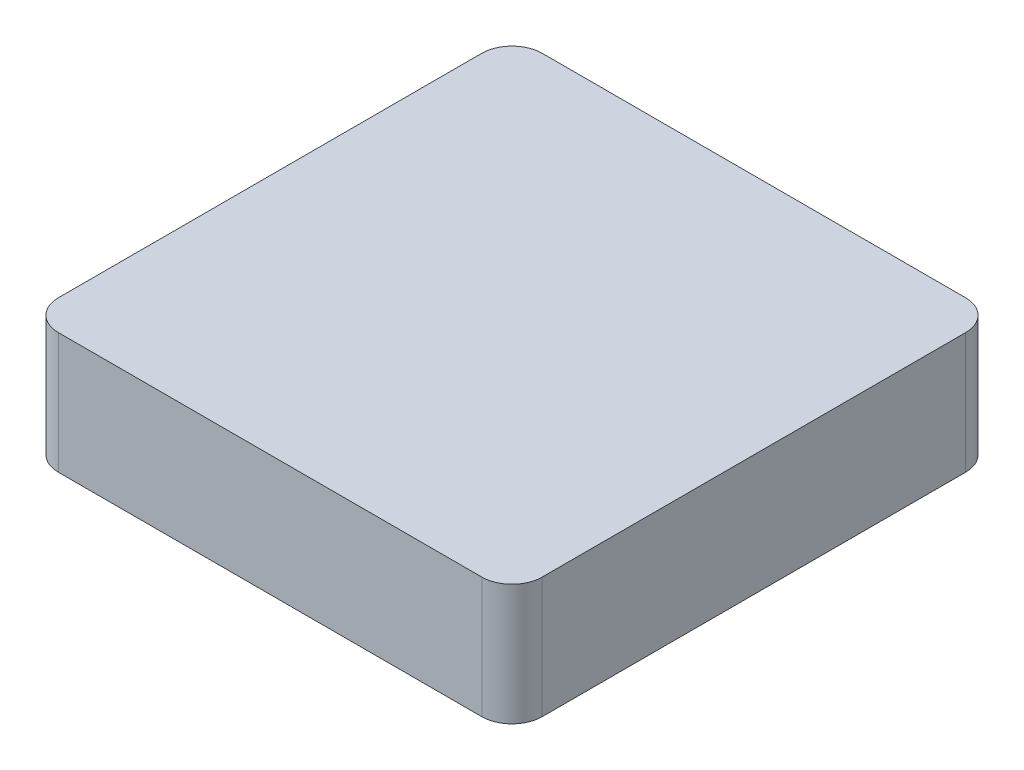
ISO-10303-21;
HEADER;
FILE_DESCRIPTION(('STEP AP214'),'2;1');
FILE_NAME('part.step','',(''),(''),'','','');
FILE_SCHEMA(('AUTOMOTIVE_DESIGN { 1 0 10303 214 1 1 1 1 }'));
ENDSEC;
DATA;
#1=APPLICATION_CONTEXT('core data for automotive mechanical design processes');
#2=APPLICATION_PROTOCOL_DEFINITION('international standard','automotive_design',2000,#1);
#3=PRODUCT_CONTEXT('',#1,'mechanical');
#4=PRODUCT('Part','Part','',(#3));
#5=PRODUCT_RELATED_PRODUCT_CATEGORY('part','',(#4));
#6=PRODUCT_DEFINITION_FORMATION('','',#4);
#7=PRODUCT_DEFINITION_CONTEXT('part definition',#1,'design');
#8=PRODUCT_DEFINITION('design','',#6,#7);
#9=PRODUCT_DEFINITION_SHAPE('','',#8);
#10=(LENGTH_UNIT() NAMED_UNIT(*) SI_UNIT(.MILLI.,.METRE.));
#11=(NAMED_UNIT(*) PLANE_ANGLE_UNIT() SI_UNIT($,.RADIAN.));
#12=(NAMED_UNIT(*) SI_UNIT($,.STERADIAN.) SOLID_ANGLE_UNIT());
#13=UNCERTAINTY_MEASURE_WITH_UNIT(LENGTH_MEASURE(1.E-05),#10,'distance_accuracy_value','');
#14=(GEOMETRIC_REPRESENTATION_CONTEXT(3) GLOBAL_UNCERTAINTY_ASSIGNED_CONTEXT((#13)) GLOBAL_UNIT_ASSIGNED_CONTEXT((#10,
#11,#12)) REPRESENTATION_CONTEXT('',''));
#15=CARTESIAN_POINT('',(0.,0.,0.));
#16=DIRECTION('',(0.,0.,1.));
#17=DIRECTION('',(1.,0.,0.));
#18=AXIS2_PLACEMENT_3D('',#15,#16,#17);
#19=CARTESIAN_POINT('',(0.,0.,-80.));
#20=DIRECTION('',(0.,-1.,0.));
#21=DIRECTION('',(0.,0.,-1.));
#22=AXIS2_PLACEMENT_3D('',#19,#20,#21);
#23=PLANE('',#22);
#24=DIRECTION('',(-1.,0.,0.));
#25=VECTOR('',#24,1.);
#26=CARTESIAN_POINT('',(0.,0.,-80.));
#27=LINE('',#26,#25);
#28=CARTESIAN_POINT('',(75.,0.,-80.));
#29=VERTEX_POINT('',#28);
#30=CARTESIAN_POINT('',(4.99999999999997,0.,-80.));
#31=VERTEX_POINT('',#30);
#32=EDGE_CURVE('E212',#29,#31,#27,.T.);
#33=ORIENTED_EDGE('',*,*,#32,.F.);
#34=CARTESIAN_POINT('',(75.,0.,-75.));
#35=DIRECTION('',(0.,-1.,0.));
#36=DIRECTION('',(0.,0.,-1.));
#37=AXIS2_PLACEMENT_3D('',#34,#35,#36);
#38=CIRCLE('',#37,5.);
#39=CARTESIAN_POINT('',(80.,0.,-75.));
#40=VERTEX_POINT('',#39);
#41=EDGE_CURVE('E240',#29,#40,#38,.T.);
#42=ORIENTED_EDGE('',*,*,#41,.T.);
#43=DIRECTION('',(0.,0.,-1.));
#44=VECTOR('',#43,1.);
#45=CARTESIAN_POINT('',(80.,0.,0.));
#46=LINE('',#45,#44);
#47=CARTESIAN_POINT('',(80.,0.,-5.));
#48=VERTEX_POINT('',#47);
#49=EDGE_CURVE('E225',#48,#40,#46,.T.);
#50=ORIENTED_EDGE('',*,*,#49,.F.);
#51=CARTESIAN_POINT('',(75.,0.,-5.));
#52=DIRECTION('',(0.,-1.,0.));
#53=DIRECTION('',(0.,0.,-1.));
#54=AXIS2_PLACEMENT_3D('',#51,#52,#53);
#55=CIRCLE('',#54,5.);
#56=CARTESIAN_POINT('',(75.,0.,0.));
#57=VERTEX_POINT('',#56);
#58=EDGE_CURVE('E238',#48,#57,#55,.T.);
#59=ORIENTED_EDGE('',*,*,#58,.T.);
#60=DIRECTION('',(1.,0.,0.));
#61=VECTOR('',#60,1.);
#62=CARTESIAN_POINT('',(0.,0.,0.));
#63=LINE('',#62,#61);
#64=CARTESIAN_POINT('',(5.,0.,0.));
#65=VERTEX_POINT('',#64);
#66=EDGE_CURVE('E223',#65,#57,#63,.T.);
#67=ORIENTED_EDGE('',*,*,#66,.F.);
#68=CARTESIAN_POINT('',(5.,0.,-5.));
#69=DIRECTION('',(0.,-1.,0.));
#70=DIRECTION('',(0.,0.,-1.));
#71=AXIS2_PLACEMENT_3D('',#68,#69,#70);
#72=CIRCLE('',#71,5.);
#73=CARTESIAN_POINT('',(0.,0.,-5.));
#74=VERTEX_POINT('',#73);
#75=EDGE_CURVE('E236',#65,#74,#72,.T.);
#76=ORIENTED_EDGE('',*,*,#75,.T.);
#77=DIRECTION('',(0.,0.,1.));
#78=VECTOR('',#77,1.);
#79=CARTESIAN_POINT('',(0.,0.,0.));
#80=LINE('',#79,#78);
#81=CARTESIAN_POINT('',(0.,0.,-75.));
#82=VERTEX_POINT('',#81);
#83=EDGE_CURVE('E153',#82,#74,#80,.T.);
#84=ORIENTED_EDGE('',*,*,#83,.F.);
#85=CARTESIAN_POINT('',(4.99999999999997,0.,-75.));
#86=DIRECTION('',(0.,-1.,0.));
#87=DIRECTION('',(0.,0.,-1.));
#88=AXIS2_PLACEMENT_3D('',#85,#86,#87);
#89=CIRCLE('',#88,5.);
#90=EDGE_CURVE('E234',#82,#31,#89,.T.);
#91=ORIENTED_EDGE('',*,*,#90,.T.);
#92=EDGE_LOOP('',(#33,#42,#50,#59,#67,#76,#84,#91));
#93=FACE_BOUND('',#92,.T.);
#94=CARTESIAN_POINT('',(75.,0.,-75.));
#95=DIRECTION('',(0.,-1.,0.));
#96=DIRECTION('',(0.,0.,-1.));
#97=AXIS2_PLACEMENT_3D('',#94,#95,#96);
#98=CIRCLE('',#97,3.);
#99=CARTESIAN_POINT('',(75.,0.,-78.));
#100=VERTEX_POINT('',#99);
#101=CARTESIAN_POINT('',(78.,0.,-75.));
#102=VERTEX_POINT('',#101);
#103=EDGE_CURVE('E186',#100,#102,#98,.T.);
#104=ORIENTED_EDGE('',*,*,#103,.F.);
#105=DIRECTION('',(-1.,0.,0.));
#106=VECTOR('',#105,1.);
#107=CARTESIAN_POINT('',(0.,0.,-78.));
#108=LINE('',#107,#106);
#109=CARTESIAN_POINT('',(4.99999999999997,0.,-78.));
#110=VERTEX_POINT('',#109);
#111=EDGE_CURVE('E162',#100,#110,#108,.T.);
#112=ORIENTED_EDGE('',*,*,#111,.T.);
#113=CARTESIAN_POINT('',(4.99999999999997,0.,-75.));
#114=DIRECTION('',(0.,-1.,0.));
#115=DIRECTION('',(0.,0.,-1.));
#116=AXIS2_PLACEMENT_3D('',#113,#114,#115);
#117=CIRCLE('',#116,3.);
#118=CARTESIAN_POINT('',(1.99999999999997,0.,-75.));
#119=VERTEX_POINT('',#118);
#120=EDGE_CURVE('E190',#119,#110,#117,.T.);
#121=ORIENTED_EDGE('',*,*,#120,.F.);
#122=DIRECTION('',(0.,0.,1.));
#123=VECTOR('',#122,1.);
#124=CARTESIAN_POINT('',(1.99999999999997,0.,-80.));
#125=LINE('',#124,#123);
#126=CARTESIAN_POINT('',(2.,0.,-5.));
#127=VERTEX_POINT('',#126);
#128=EDGE_CURVE('E46',#119,#127,#125,.T.);
#129=ORIENTED_EDGE('',*,*,#128,.T.);
#130=CARTESIAN_POINT('',(5.,0.,-5.));
#131=DIRECTION('',(0.,-1.,0.));
#132=DIRECTION('',(0.,0.,-1.));
#133=AXIS2_PLACEMENT_3D('',#130,#131,#132);
#134=CIRCLE('',#133,3.);
#135=CARTESIAN_POINT('',(5.,0.,-2.));
#136=VERTEX_POINT('',#135);
#137=EDGE_CURVE('E152',#136,#127,#134,.T.);
#138=ORIENTED_EDGE('',*,*,#137,.F.);
#139=DIRECTION('',(1.,0.,0.));
#140=VECTOR('',#139,1.);
#141=CARTESIAN_POINT('',(0.,0.,-2.));
#142=LINE('',#141,#140);
#143=CARTESIAN_POINT('',(75.,0.,-2.));
#144=VERTEX_POINT('',#143);
#145=EDGE_CURVE('E195',#136,#144,#142,.T.);
#146=ORIENTED_EDGE('',*,*,#145,.T.);
#147=CARTESIAN_POINT('',(75.,0.,-5.));
#148=DIRECTION('',(0.,-1.,0.));
#149=DIRECTION('',(0.,0.,-1.));
#150=AXIS2_PLACEMENT_3D('',#147,#148,#149);
#151=CIRCLE('',#150,3.);
#152=CARTESIAN_POINT('',(78.,0.,-5.));
#153=VERTEX_POINT('',#152);
#154=EDGE_CURVE('E201',#153,#144,#151,.T.);
#155=ORIENTED_EDGE('',*,*,#154,.F.);
#156=DIRECTION('',(0.,0.,-1.));
#157=VECTOR('',#156,1.);
#158=CARTESIAN_POINT('',(78.,0.,-80.));
#159=LINE('',#158,#157);
#160=EDGE_CURVE('E199',#153,#102,#159,.T.);
#161=ORIENTED_EDGE('',*,*,#160,.T.);
#162=EDGE_LOOP('',(#104,#112,#121,#129,#138,#146,#155,#161));
#163=FACE_BOUND('',#162,.T.);
#164=ADVANCED_FACE('F31',(#93,#163),#23,.T.);
#165=CARTESIAN_POINT('',(0.,20.,0.));
#166=DIRECTION('',(1.,0.,0.));
#167=DIRECTION('',(0.,0.,-1.));
#168=AXIS2_PLACEMENT_3D('',#165,#166,#167);
#169=PLANE('',#168);
#170=ORIENTED_EDGE('',*,*,#83,.T.);
#171=DIRECTION('',(0.,-1.,0.));
#172=VECTOR('',#171,1.);
#173=CARTESIAN_POINT('',(0.,20.,-5.));
#174=LINE('',#173,#172);
#175=CARTESIAN_POINT('',(0.,20.,-5.));
#176=VERTEX_POINT('',#175);
#177=EDGE_CURVE('E11',#74,#176,#174,.F.);
#178=ORIENTED_EDGE('',*,*,#177,.T.);
#179=DIRECTION('',(0.,0.,1.));
#180=VECTOR('',#179,1.);
#181=CARTESIAN_POINT('',(0.,20.,0.));
#182=LINE('',#181,#180);
#183=CARTESIAN_POINT('',(0.,20.,-75.));
#184=VERTEX_POINT('',#183);
#185=EDGE_CURVE('E208',#184,#176,#182,.T.);
#186=ORIENTED_EDGE('',*,*,#185,.F.);
#187=DIRECTION('',(0.,-1.,0.));
#188=VECTOR('',#187,1.);
#189=CARTESIAN_POINT('',(0.,20.,-75.));
#190=LINE('',#189,#188);
#191=EDGE_CURVE('E39',#184,#82,#190,.T.);
#192=ORIENTED_EDGE('',*,*,#191,.T.);
#193=EDGE_LOOP('',(#170,#178,#186,#192));
#194=FACE_BOUND('',#193,.T.);
#195=ADVANCED_FACE('F263',(#194),#169,.F.);
#196=CARTESIAN_POINT('',(0.,20.,0.));
#197=DIRECTION('',(0.,0.,-1.));
#198=DIRECTION('',(-1.,0.,0.));
#199=AXIS2_PLACEMENT_3D('',#196,#197,#198);
#200=PLANE('',#199);
#201=ORIENTED_EDGE('',*,*,#66,.T.);
#202=DIRECTION('',(0.,-1.,0.));
#203=VECTOR('',#202,1.);
#204=CARTESIAN_POINT('',(75.,20.,0.));
#205=LINE('',#204,#203);
#206=CARTESIAN_POINT('',(75.,20.,0.));
#207=VERTEX_POINT('',#206);
#208=EDGE_CURVE('E54',#57,#207,#205,.F.);
#209=ORIENTED_EDGE('',*,*,#208,.T.);
#210=DIRECTION('',(1.,0.,0.));
#211=VECTOR('',#210,1.);
#212=CARTESIAN_POINT('',(0.,20.,0.));
#213=LINE('',#212,#211);
#214=CARTESIAN_POINT('',(5.,20.,0.));
#215=VERTEX_POINT('',#214);
#216=EDGE_CURVE('E211',#215,#207,#213,.T.);
#217=ORIENTED_EDGE('',*,*,#216,.F.);
#218=DIRECTION('',(0.,-1.,0.));
#219=VECTOR('',#218,1.);
#220=CARTESIAN_POINT('',(5.,20.,0.));
#221=LINE('',#220,#219);
#222=EDGE_CURVE('E255',#215,#65,#221,.T.);
#223=ORIENTED_EDGE('',*,*,#222,.T.);
#224=EDGE_LOOP('',(#201,#209,#217,#223));
#225=FACE_BOUND('',#224,.T.);
#226=ADVANCED_FACE('F275',(#225),#200,.F.);
#227=CARTESIAN_POINT('',(80.,20.,0.));
#228=DIRECTION('',(-1.,0.,0.));
#229=DIRECTION('',(0.,0.,1.));
#230=AXIS2_PLACEMENT_3D('',#227,#228,#229);
#231=PLANE('',#230);
#232=ORIENTED_EDGE('',*,*,#49,.T.);
#233=DIRECTION('',(0.,-1.,0.));
#234=VECTOR('',#233,1.);
#235=CARTESIAN_POINT('',(80.,20.,-75.));
#236=LINE('',#235,#234);
#237=CARTESIAN_POINT('',(80.,20.,-75.));
#238=VERTEX_POINT('',#237);
#239=EDGE_CURVE('E245',#40,#238,#236,.F.);
#240=ORIENTED_EDGE('',*,*,#239,.T.);
#241=DIRECTION('',(0.,0.,-1.));
#242=VECTOR('',#241,1.);
#243=CARTESIAN_POINT('',(80.,20.,0.));
#244=LINE('',#243,#242);
#245=CARTESIAN_POINT('',(80.,20.,-5.));
#246=VERTEX_POINT('',#245);
#247=EDGE_CURVE('E214',#246,#238,#244,.T.);
#248=ORIENTED_EDGE('',*,*,#247,.F.);
#249=DIRECTION('',(0.,-1.,0.));
#250=VECTOR('',#249,1.);
#251=CARTESIAN_POINT('',(80.,20.,-5.));
#252=LINE('',#251,#250);
#253=EDGE_CURVE('E242',#246,#48,#252,.T.);
#254=ORIENTED_EDGE('',*,*,#253,.T.);
#255=EDGE_LOOP('',(#232,#240,#248,#254));
#256=FACE_BOUND('',#255,.T.);
#257=ADVANCED_FACE('F285',(#256),#231,.F.);
#258=CARTESIAN_POINT('',(0.,20.,-80.));
#259=DIRECTION('',(0.,0.,1.));
#260=DIRECTION('',(1.,0.,0.));
#261=AXIS2_PLACEMENT_3D('',#258,#259,#260);
#262=PLANE('',#261);
#263=DIRECTION('',(-1.,0.,0.));
#264=VECTOR('',#263,1.);
#265=CARTESIAN_POINT('',(0.,20.,-80.));
#266=LINE('',#265,#264);
#267=CARTESIAN_POINT('',(75.,20.,-80.));
#268=VERTEX_POINT('',#267);
#269=CARTESIAN_POINT('',(4.99999999999997,20.,-80.));
#270=VERTEX_POINT('',#269);
#271=EDGE_CURVE('E217',#268,#270,#266,.T.);
#272=ORIENTED_EDGE('',*,*,#271,.F.);
#273=DIRECTION('',(0.,-1.,0.));
#274=VECTOR('',#273,1.);
#275=CARTESIAN_POINT('',(75.,20.,-80.));
#276=LINE('',#275,#274);
#277=EDGE_CURVE('E231',#268,#29,#276,.T.);
#278=ORIENTED_EDGE('',*,*,#277,.T.);
#279=ORIENTED_EDGE('',*,*,#32,.T.);
#280=DIRECTION('',(0.,-1.,0.));
#281=VECTOR('',#280,1.);
#282=CARTESIAN_POINT('',(4.99999999999997,20.,-80.));
#283=LINE('',#282,#281);
#284=EDGE_CURVE('E220',#31,#270,#283,.F.);
#285=ORIENTED_EDGE('',*,*,#284,.T.);
#286=EDGE_LOOP('',(#272,#278,#279,#285));
#287=FACE_BOUND('',#286,.T.);
#288=ADVANCED_FACE('F293',(#287),#262,.F.);
#289=CARTESIAN_POINT('',(0.,20.,-80.));
#290=DIRECTION('',(0.,-1.,0.));
#291=DIRECTION('',(0.,0.,-1.));
#292=AXIS2_PLACEMENT_3D('',#289,#290,#291);
#293=PLANE('',#292);
#294=ORIENTED_EDGE('',*,*,#247,.T.);
#295=CARTESIAN_POINT('',(75.,20.,-75.));
#296=DIRECTION('',(0.,-1.,0.));
#297=DIRECTION('',(0.,0.,-1.));
#298=AXIS2_PLACEMENT_3D('',#295,#296,#297);
#299=CIRCLE('',#298,5.);
#300=EDGE_CURVE('E253',#238,#268,#299,.F.);
#301=ORIENTED_EDGE('',*,*,#300,.T.);
#302=ORIENTED_EDGE('',*,*,#271,.T.);
#303=CARTESIAN_POINT('',(4.99999999999997,20.,-75.));
#304=DIRECTION('',(0.,-1.,0.));
#305=DIRECTION('',(0.,0.,-1.));
#306=AXIS2_PLACEMENT_3D('',#303,#304,#305);
#307=CIRCLE('',#306,5.);
#308=EDGE_CURVE('E247',#270,#184,#307,.F.);
#309=ORIENTED_EDGE('',*,*,#308,.T.);
#310=ORIENTED_EDGE('',*,*,#185,.T.);
#311=CARTESIAN_POINT('',(5.,20.,-5.));
#312=DIRECTION('',(0.,-1.,0.));
#313=DIRECTION('',(0.,0.,-1.));
#314=AXIS2_PLACEMENT_3D('',#311,#312,#313);
#315=CIRCLE('',#314,5.);
#316=EDGE_CURVE('E249',#176,#215,#315,.F.);
#317=ORIENTED_EDGE('',*,*,#316,.T.);
#318=ORIENTED_EDGE('',*,*,#216,.T.);
#319=CARTESIAN_POINT('',(75.,20.,-5.));
#320=DIRECTION('',(0.,-1.,0.));
#321=DIRECTION('',(0.,0.,-1.));
#322=AXIS2_PLACEMENT_3D('',#319,#320,#321);
#323=CIRCLE('',#322,5.);
#324=EDGE_CURVE('E251',#207,#246,#323,.F.);
#325=ORIENTED_EDGE('',*,*,#324,.T.);
#326=EDGE_LOOP('',(#294,#301,#302,#309,#310,#317,#318,#325));
#327=FACE_BOUND('',#326,.T.);
#328=ADVANCED_FACE('F278',(#327),#293,.F.);
#329=CARTESIAN_POINT('',(75.,20.,-75.));
#330=DIRECTION('',(0.,-1.,0.));
#331=DIRECTION('',(0.,0.,-1.));
#332=AXIS2_PLACEMENT_3D('',#329,#330,#331);
#333=CYLINDRICAL_SURFACE('',#332,5.);
#334=ORIENTED_EDGE('',*,*,#300,.F.);
#335=ORIENTED_EDGE('',*,*,#239,.F.);
#336=ORIENTED_EDGE('',*,*,#41,.F.);
#337=ORIENTED_EDGE('',*,*,#277,.F.);
#338=EDGE_LOOP('',(#334,#335,#336,#337));
#339=FACE_BOUND('',#338,.T.);
#340=ADVANCED_FACE('F290',(#339),#333,.T.);
#341=CARTESIAN_POINT('',(75.,20.,-5.));
#342=DIRECTION('',(0.,-1.,0.));
#343=DIRECTION('',(0.,0.,-1.));
#344=AXIS2_PLACEMENT_3D('',#341,#342,#343);
#345=CYLINDRICAL_SURFACE('',#344,5.);
#346=ORIENTED_EDGE('',*,*,#324,.F.);
#347=ORIENTED_EDGE('',*,*,#208,.F.);
#348=ORIENTED_EDGE('',*,*,#58,.F.);
#349=ORIENTED_EDGE('',*,*,#253,.F.);
#350=EDGE_LOOP('',(#346,#347,#348,#349));
#351=FACE_BOUND('',#350,.T.);
#352=ADVANCED_FACE('F282',(#351),#345,.T.);
#353=CARTESIAN_POINT('',(5.,20.,-5.));
#354=DIRECTION('',(0.,-1.,0.));
#355=DIRECTION('',(0.,0.,-1.));
#356=AXIS2_PLACEMENT_3D('',#353,#354,#355);
#357=CYLINDRICAL_SURFACE('',#356,5.);
#358=ORIENTED_EDGE('',*,*,#316,.F.);
#359=ORIENTED_EDGE('',*,*,#177,.F.);
#360=ORIENTED_EDGE('',*,*,#75,.F.);
#361=ORIENTED_EDGE('',*,*,#222,.F.);
#362=EDGE_LOOP('',(#358,#359,#360,#361));
#363=FACE_BOUND('',#362,.T.);
#364=ADVANCED_FACE('F274',(#363),#357,.T.);
#365=CARTESIAN_POINT('',(4.99999999999997,20.,-75.));
#366=DIRECTION('',(0.,-1.,0.));
#367=DIRECTION('',(0.,0.,-1.));
#368=AXIS2_PLACEMENT_3D('',#365,#366,#367);
#369=CYLINDRICAL_SURFACE('',#368,5.);
#370=ORIENTED_EDGE('',*,*,#308,.F.);
#371=ORIENTED_EDGE('',*,*,#284,.F.);
#372=ORIENTED_EDGE('',*,*,#90,.F.);
#373=ORIENTED_EDGE('',*,*,#191,.F.);
#374=EDGE_LOOP('',(#370,#371,#372,#373));
#375=FACE_BOUND('',#374,.T.);
#376=ADVANCED_FACE('F33',(#375),#369,.T.);
#377=CARTESIAN_POINT('',(2.,20.,0.));
#378=DIRECTION('',(1.,0.,0.));
#379=DIRECTION('',(0.,0.,-1.));
#380=AXIS2_PLACEMENT_3D('',#377,#378,#379);
#381=PLANE('',#380);
#382=ORIENTED_EDGE('',*,*,#128,.F.);
#383=DIRECTION('',(0.,1.,0.));
#384=VECTOR('',#383,1.);
#385=CARTESIAN_POINT('',(1.99999999999997,20.,-75.));
#386=LINE('',#385,#384);
#387=CARTESIAN_POINT('',(1.99999999999997,18.,-75.));
#388=VERTEX_POINT('',#387);
#389=EDGE_CURVE('E154',#388,#119,#386,.F.);
#390=ORIENTED_EDGE('',*,*,#389,.F.);
#391=DIRECTION('',(0.,0.,1.));
#392=VECTOR('',#391,1.);
#393=CARTESIAN_POINT('',(1.99999999999997,18.,-80.));
#394=LINE('',#393,#392);
#395=CARTESIAN_POINT('',(2.,18.,-5.));
#396=VERTEX_POINT('',#395);
#397=EDGE_CURVE('E157',#388,#396,#394,.T.);
#398=ORIENTED_EDGE('',*,*,#397,.T.);
#399=DIRECTION('',(0.,1.,0.));
#400=VECTOR('',#399,1.);
#401=CARTESIAN_POINT('',(2.,20.,-5.));
#402=LINE('',#401,#400);
#403=EDGE_CURVE('E145',#127,#396,#402,.T.);
#404=ORIENTED_EDGE('',*,*,#403,.F.);
#405=EDGE_LOOP('',(#382,#390,#398,#404));
#406=FACE_BOUND('',#405,.T.);
#407=ADVANCED_FACE('F158',(#406),#381,.T.);
#408=CARTESIAN_POINT('',(0.,20.,-2.));
#409=DIRECTION('',(0.,0.,-1.));
#410=DIRECTION('',(-1.,0.,0.));
#411=AXIS2_PLACEMENT_3D('',#408,#409,#410);
#412=PLANE('',#411);
#413=ORIENTED_EDGE('',*,*,#145,.F.);
#414=DIRECTION('',(0.,1.,0.));
#415=VECTOR('',#414,1.);
#416=CARTESIAN_POINT('',(5.,20.,-2.));
#417=LINE('',#416,#415);
#418=CARTESIAN_POINT('',(5.,18.,-2.));
#419=VERTEX_POINT('',#418);
#420=EDGE_CURVE('E182',#419,#136,#417,.F.);
#421=ORIENTED_EDGE('',*,*,#420,.F.);
#422=DIRECTION('',(1.,0.,0.));
#423=VECTOR('',#422,1.);
#424=CARTESIAN_POINT('',(0.,18.,-2.));
#425=LINE('',#424,#423);
#426=CARTESIAN_POINT('',(75.,18.,-2.));
#427=VERTEX_POINT('',#426);
#428=EDGE_CURVE('E161',#419,#427,#425,.T.);
#429=ORIENTED_EDGE('',*,*,#428,.T.);
#430=DIRECTION('',(0.,1.,0.));
#431=VECTOR('',#430,1.);
#432=CARTESIAN_POINT('',(75.,20.,-2.));
#433=LINE('',#432,#431);
#434=EDGE_CURVE('E180',#144,#427,#433,.T.);
#435=ORIENTED_EDGE('',*,*,#434,.F.);
#436=EDGE_LOOP('',(#413,#421,#429,#435));
#437=FACE_BOUND('',#436,.T.);
#438=ADVANCED_FACE('F300',(#437),#412,.T.);
#439=CARTESIAN_POINT('',(78.,20.,0.));
#440=DIRECTION('',(-1.,0.,0.));
#441=DIRECTION('',(0.,0.,1.));
#442=AXIS2_PLACEMENT_3D('',#439,#440,#441);
#443=PLANE('',#442);
#444=ORIENTED_EDGE('',*,*,#160,.F.);
#445=DIRECTION('',(0.,1.,0.));
#446=VECTOR('',#445,1.);
#447=CARTESIAN_POINT('',(78.,20.,-5.));
#448=LINE('',#447,#446);
#449=CARTESIAN_POINT('',(78.,18.,-5.));
#450=VERTEX_POINT('',#449);
#451=EDGE_CURVE('E184',#450,#153,#448,.F.);
#452=ORIENTED_EDGE('',*,*,#451,.F.);
#453=DIRECTION('',(0.,0.,-1.));
#454=VECTOR('',#453,1.);
#455=CARTESIAN_POINT('',(78.,18.,-80.));
#456=LINE('',#455,#454);
#457=CARTESIAN_POINT('',(78.,18.,-75.));
#458=VERTEX_POINT('',#457);
#459=EDGE_CURVE('E178',#450,#458,#456,.T.);
#460=ORIENTED_EDGE('',*,*,#459,.T.);
#461=DIRECTION('',(0.,1.,0.));
#462=VECTOR('',#461,1.);
#463=CARTESIAN_POINT('',(78.,20.,-75.));
#464=LINE('',#463,#462);
#465=EDGE_CURVE('E174',#102,#458,#464,.T.);
#466=ORIENTED_EDGE('',*,*,#465,.F.);
#467=EDGE_LOOP('',(#444,#452,#460,#466));
#468=FACE_BOUND('',#467,.T.);
#469=ADVANCED_FACE('F352',(#468),#443,.T.);
#470=CARTESIAN_POINT('',(0.,20.,-78.));
#471=DIRECTION('',(0.,0.,1.));
#472=DIRECTION('',(1.,0.,0.));
#473=AXIS2_PLACEMENT_3D('',#470,#471,#472);
#474=PLANE('',#473);
#475=DIRECTION('',(-1.,0.,0.));
#476=VECTOR('',#475,1.);
#477=CARTESIAN_POINT('',(0.,18.,-78.));
#478=LINE('',#477,#476);
#479=CARTESIAN_POINT('',(75.,18.,-78.));
#480=VERTEX_POINT('',#479);
#481=CARTESIAN_POINT('',(4.99999999999997,18.,-78.));
#482=VERTEX_POINT('',#481);
#483=EDGE_CURVE('E193',#480,#482,#478,.T.);
#484=ORIENTED_EDGE('',*,*,#483,.T.);
#485=DIRECTION('',(0.,1.,0.));
#486=VECTOR('',#485,1.);
#487=CARTESIAN_POINT('',(4.99999999999997,20.,-78.));
#488=LINE('',#487,#486);
#489=EDGE_CURVE('E191',#110,#482,#488,.T.);
#490=ORIENTED_EDGE('',*,*,#489,.F.);
#491=ORIENTED_EDGE('',*,*,#111,.F.);
#492=DIRECTION('',(0.,1.,0.));
#493=VECTOR('',#492,1.);
#494=CARTESIAN_POINT('',(75.,20.,-78.));
#495=LINE('',#494,#493);
#496=EDGE_CURVE('E188',#480,#100,#495,.F.);
#497=ORIENTED_EDGE('',*,*,#496,.F.);
#498=EDGE_LOOP('',(#484,#490,#491,#497));
#499=FACE_BOUND('',#498,.T.);
#500=ADVANCED_FACE('F362',(#499),#474,.T.);
#501=CARTESIAN_POINT('',(0.,18.,-80.));
#502=DIRECTION('',(0.,-1.,0.));
#503=DIRECTION('',(0.,0.,-1.));
#504=AXIS2_PLACEMENT_3D('',#501,#502,#503);
#505=PLANE('',#504);
#506=ORIENTED_EDGE('',*,*,#459,.F.);
#507=CARTESIAN_POINT('',(75.,18.,-5.));
#508=DIRECTION('',(0.,-1.,0.));
#509=DIRECTION('',(0.,0.,-1.));
#510=AXIS2_PLACEMENT_3D('',#507,#508,#509);
#511=CIRCLE('',#510,3.);
#512=EDGE_CURVE('E169',#427,#450,#511,.F.);
#513=ORIENTED_EDGE('',*,*,#512,.F.);
#514=ORIENTED_EDGE('',*,*,#428,.F.);
#515=CARTESIAN_POINT('',(5.,18.,-5.));
#516=DIRECTION('',(0.,-1.,0.));
#517=DIRECTION('',(0.,0.,-1.));
#518=AXIS2_PLACEMENT_3D('',#515,#516,#517);
#519=CIRCLE('',#518,3.);
#520=EDGE_CURVE('E149',#396,#419,#519,.F.);
#521=ORIENTED_EDGE('',*,*,#520,.F.);
#522=ORIENTED_EDGE('',*,*,#397,.F.);
#523=CARTESIAN_POINT('',(4.99999999999997,18.,-75.));
#524=DIRECTION('',(0.,-1.,0.));
#525=DIRECTION('',(0.,0.,-1.));
#526=AXIS2_PLACEMENT_3D('',#523,#524,#525);
#527=CIRCLE('',#526,3.);
#528=EDGE_CURVE('E170',#482,#388,#527,.F.);
#529=ORIENTED_EDGE('',*,*,#528,.F.);
#530=ORIENTED_EDGE('',*,*,#483,.F.);
#531=CARTESIAN_POINT('',(75.,18.,-75.));
#532=DIRECTION('',(0.,-1.,0.));
#533=DIRECTION('',(0.,0.,-1.));
#534=AXIS2_PLACEMENT_3D('',#531,#532,#533);
#535=CIRCLE('',#534,3.);
#536=EDGE_CURVE('E172',#458,#480,#535,.F.);
#537=ORIENTED_EDGE('',*,*,#536,.F.);
#538=EDGE_LOOP('',(#506,#513,#514,#521,#522,#529,#530,#537));
#539=FACE_BOUND('',#538,.T.);
#540=ADVANCED_FACE('F165',(#539),#505,.T.);
#541=CARTESIAN_POINT('',(75.,20.,-75.));
#542=DIRECTION('',(0.,-1.,0.));
#543=DIRECTION('',(0.,0.,-1.));
#544=AXIS2_PLACEMENT_3D('',#541,#542,#543);
#545=CYLINDRICAL_SURFACE('',#544,3.);
#546=ORIENTED_EDGE('',*,*,#536,.T.);
#547=ORIENTED_EDGE('',*,*,#496,.T.);
#548=ORIENTED_EDGE('',*,*,#103,.T.);
#549=ORIENTED_EDGE('',*,*,#465,.T.);
#550=EDGE_LOOP('',(#546,#547,#548,#549));
#551=FACE_BOUND('',#550,.T.);
#552=ADVANCED_FACE('F381',(#551),#545,.F.);
#553=CARTESIAN_POINT('',(75.,20.,-5.));
#554=DIRECTION('',(0.,-1.,0.));
#555=DIRECTION('',(0.,0.,-1.));
#556=AXIS2_PLACEMENT_3D('',#553,#554,#555);
#557=CYLINDRICAL_SURFACE('',#556,3.);
#558=ORIENTED_EDGE('',*,*,#512,.T.);
#559=ORIENTED_EDGE('',*,*,#451,.T.);
#560=ORIENTED_EDGE('',*,*,#154,.T.);
#561=ORIENTED_EDGE('',*,*,#434,.T.);
#562=EDGE_LOOP('',(#558,#559,#560,#561));
#563=FACE_BOUND('',#562,.T.);
#564=ADVANCED_FACE('F390',(#563),#557,.F.);
#565=CARTESIAN_POINT('',(5.,20.,-5.));
#566=DIRECTION('',(0.,-1.,0.));
#567=DIRECTION('',(0.,0.,-1.));
#568=AXIS2_PLACEMENT_3D('',#565,#566,#567);
#569=CYLINDRICAL_SURFACE('',#568,3.);
#570=ORIENTED_EDGE('',*,*,#520,.T.);
#571=ORIENTED_EDGE('',*,*,#420,.T.);
#572=ORIENTED_EDGE('',*,*,#137,.T.);
#573=ORIENTED_EDGE('',*,*,#403,.T.);
#574=EDGE_LOOP('',(#570,#571,#572,#573));
#575=FACE_BOUND('',#574,.T.);
#576=ADVANCED_FACE('F147',(#575),#569,.F.);
#577=CARTESIAN_POINT('',(4.99999999999997,20.,-75.));
#578=DIRECTION('',(0.,-1.,0.));
#579=DIRECTION('',(0.,0.,-1.));
#580=AXIS2_PLACEMENT_3D('',#577,#578,#579);
#581=CYLINDRICAL_SURFACE('',#580,3.);
#582=ORIENTED_EDGE('',*,*,#528,.T.);
#583=ORIENTED_EDGE('',*,*,#389,.T.);
#584=ORIENTED_EDGE('',*,*,#120,.T.);
#585=ORIENTED_EDGE('',*,*,#489,.T.);
#586=EDGE_LOOP('',(#582,#583,#584,#585));
#587=FACE_BOUND('',#586,.T.);
#588=ADVANCED_FACE('F409',(#587),#581,.F.);
#589=CLOSED_SHELL('',(#164,#195,#226,#257,#288,#328,#340,#352,#364,#376,#407,#438,#469,#500,
#540,#552,#564,#576,#588));
#590=MANIFOLD_SOLID_BREP('B2',#589);
#591=ADVANCED_BREP_SHAPE_REPRESENTATION('',(#18,#590),#14);
#592=SHAPE_DEFINITION_REPRESENTATION(#9,#591);
ENDSEC;
END-ISO-10303-21;
